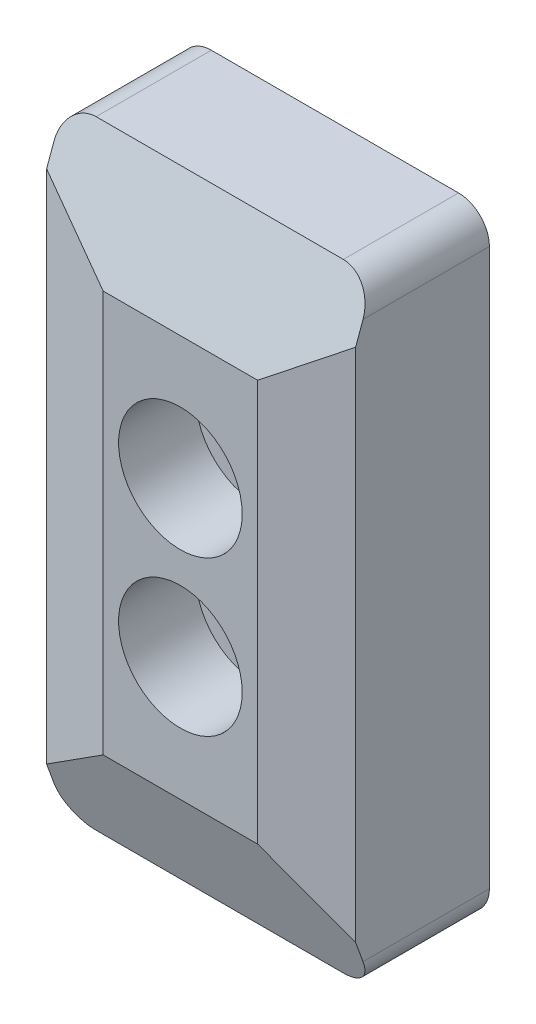
ISO-10303-21;
HEADER;
FILE_DESCRIPTION(('STEP AP214'),'2;1');
FILE_NAME('part.step','',(''),(''),'','','');
FILE_SCHEMA(('AUTOMOTIVE_DESIGN { 1 0 10303 214 1 1 1 1 }'));
ENDSEC;
DATA;
#1=APPLICATION_CONTEXT('core data for automotive mechanical design processes');
#2=APPLICATION_PROTOCOL_DEFINITION('international standard','automotive_design',2000,#1);
#3=PRODUCT_CONTEXT('',#1,'mechanical');
#4=PRODUCT('Part','Part','',(#3));
#5=PRODUCT_RELATED_PRODUCT_CATEGORY('part','',(#4));
#6=PRODUCT_DEFINITION_FORMATION('','',#4);
#7=PRODUCT_DEFINITION_CONTEXT('part definition',#1,'design');
#8=PRODUCT_DEFINITION('design','',#6,#7);
#9=PRODUCT_DEFINITION_SHAPE('','',#8);
#10=(LENGTH_UNIT() NAMED_UNIT(*) SI_UNIT(.MILLI.,.METRE.));
#11=(NAMED_UNIT(*) PLANE_ANGLE_UNIT() SI_UNIT($,.RADIAN.));
#12=(NAMED_UNIT(*) SI_UNIT($,.STERADIAN.) SOLID_ANGLE_UNIT());
#13=UNCERTAINTY_MEASURE_WITH_UNIT(LENGTH_MEASURE(1.E-05),#10,'distance_accuracy_value','');
#14=(GEOMETRIC_REPRESENTATION_CONTEXT(3) GLOBAL_UNCERTAINTY_ASSIGNED_CONTEXT((#13)) GLOBAL_UNIT_ASSIGNED_CONTEXT((#10,
#11,#12)) REPRESENTATION_CONTEXT('',''));
#15=CARTESIAN_POINT('',(0.,0.,0.));
#16=DIRECTION('',(0.,0.,1.));
#17=DIRECTION('',(1.,0.,0.));
#18=AXIS2_PLACEMENT_3D('',#15,#16,#17);
#19=CARTESIAN_POINT('',(0.,-5.,10.));
#20=DIRECTION('',(0.,0.,-1.));
#21=DIRECTION('',(-1.,0.,0.));
#22=AXIS2_PLACEMENT_3D('',#19,#20,#21);
#23=CYLINDRICAL_SURFACE('',#22,2.15);
#24=CARTESIAN_POINT('',(0.,-5.,0.));
#25=DIRECTION('',(0.,0.,1.));
#26=DIRECTION('',(1.,0.,0.));
#27=AXIS2_PLACEMENT_3D('',#24,#25,#26);
#28=CIRCLE('',#27,2.15);
#29=CARTESIAN_POINT('',(2.15,-5.,0.));
#30=VERTEX_POINT('',#29);
#31=EDGE_CURVE('E245',#30,#30,#28,.T.);
#32=ORIENTED_EDGE('',*,*,#31,.F.);
#33=EDGE_LOOP('',(#32));
#34=FACE_BOUND('',#33,.T.);
#35=CARTESIAN_POINT('',(0.,-5.,5.));
#36=DIRECTION('',(0.,0.,1.));
#37=DIRECTION('',(1.,0.,0.));
#38=AXIS2_PLACEMENT_3D('',#35,#36,#37);
#39=CIRCLE('',#38,2.15);
#40=CARTESIAN_POINT('',(2.15,-5.,5.));
#41=VERTEX_POINT('',#40);
#42=EDGE_CURVE('E188',#41,#41,#39,.T.);
#43=ORIENTED_EDGE('',*,*,#42,.T.);
#44=EDGE_LOOP('',(#43));
#45=FACE_BOUND('',#44,.T.);
#46=ADVANCED_FACE('F41',(#34,#45),#23,.F.);
#47=CARTESIAN_POINT('',(0.,5.,10.));
#48=DIRECTION('',(0.,0.,-1.));
#49=DIRECTION('',(-1.,0.,0.));
#50=AXIS2_PLACEMENT_3D('',#47,#48,#49);
#51=CYLINDRICAL_SURFACE('',#50,2.15);
#52=CARTESIAN_POINT('',(0.,5.,0.));
#53=DIRECTION('',(0.,0.,1.));
#54=DIRECTION('',(1.,0.,0.));
#55=AXIS2_PLACEMENT_3D('',#52,#53,#54);
#56=CIRCLE('',#55,2.15);
#57=CARTESIAN_POINT('',(2.15,5.,0.));
#58=VERTEX_POINT('',#57);
#59=EDGE_CURVE('E192',#58,#58,#56,.T.);
#60=ORIENTED_EDGE('',*,*,#59,.F.);
#61=EDGE_LOOP('',(#60));
#62=FACE_BOUND('',#61,.T.);
#63=CARTESIAN_POINT('',(0.,5.,5.));
#64=DIRECTION('',(0.,0.,1.));
#65=DIRECTION('',(1.,0.,0.));
#66=AXIS2_PLACEMENT_3D('',#63,#64,#65);
#67=CIRCLE('',#66,2.15);
#68=CARTESIAN_POINT('',(2.15,5.,5.));
#69=VERTEX_POINT('',#68);
#70=EDGE_CURVE('E185',#69,#69,#67,.T.);
#71=ORIENTED_EDGE('',*,*,#70,.T.);
#72=EDGE_LOOP('',(#71));
#73=FACE_BOUND('',#72,.T.);
#74=ADVANCED_FACE('F273',(#62,#73),#51,.F.);
#75=CARTESIAN_POINT('',(0.,0.,10.));
#76=DIRECTION('',(0.,0.,-1.));
#77=DIRECTION('',(-1.,0.,0.));
#78=AXIS2_PLACEMENT_3D('',#75,#76,#77);
#79=PLANE('',#78);
#80=CARTESIAN_POINT('',(0.,5.,10.));
#81=DIRECTION('',(0.,0.,1.));
#82=DIRECTION('',(1.,0.,0.));
#83=AXIS2_PLACEMENT_3D('',#80,#81,#82);
#84=CIRCLE('',#83,4.);
#85=CARTESIAN_POINT('',(4.,5.,10.));
#86=VERTEX_POINT('',#85);
#87=EDGE_CURVE('E256',#86,#86,#84,.T.);
#88=ORIENTED_EDGE('',*,*,#87,.F.);
#89=EDGE_LOOP('',(#88));
#90=FACE_BOUND('',#89,.T.);
#91=CARTESIAN_POINT('',(0.,-5.,10.));
#92=DIRECTION('',(0.,0.,1.));
#93=DIRECTION('',(1.,0.,0.));
#94=AXIS2_PLACEMENT_3D('',#91,#92,#93);
#95=CIRCLE('',#94,4.);
#96=CARTESIAN_POINT('',(4.,-5.,10.));
#97=VERTEX_POINT('',#96);
#98=EDGE_CURVE('E253',#97,#97,#95,.T.);
#99=ORIENTED_EDGE('',*,*,#98,.F.);
#100=EDGE_LOOP('',(#99));
#101=FACE_BOUND('',#100,.T.);
#102=DIRECTION('',(0.,-1.,0.));
#103=VECTOR('',#102,1.);
#104=CARTESIAN_POINT('',(-4.99999999999995,0.,10.));
#105=LINE('',#104,#103);
#106=CARTESIAN_POINT('',(-4.99999999999995,12.9999999999999,10.));
#107=VERTEX_POINT('',#106);
#108=CARTESIAN_POINT('',(-4.99999999999995,-12.9999999999999,10.));
#109=VERTEX_POINT('',#108);
#110=EDGE_CURVE('E151',#107,#109,#105,.T.);
#111=ORIENTED_EDGE('',*,*,#110,.T.);
#112=DIRECTION('',(1.,0.,0.));
#113=VECTOR('',#112,1.);
#114=CARTESIAN_POINT('',(0.,-12.9999999999999,10.));
#115=LINE('',#114,#113);
#116=CARTESIAN_POINT('',(4.99999999999994,-12.9999999999999,10.));
#117=VERTEX_POINT('',#116);
#118=EDGE_CURVE('E133',#109,#117,#115,.T.);
#119=ORIENTED_EDGE('',*,*,#118,.T.);
#120=DIRECTION('',(0.,1.,0.));
#121=VECTOR('',#120,1.);
#122=CARTESIAN_POINT('',(4.99999999999994,0.,10.));
#123=LINE('',#122,#121);
#124=CARTESIAN_POINT('',(4.99999999999994,12.9999999999999,10.));
#125=VERTEX_POINT('',#124);
#126=EDGE_CURVE('E148',#117,#125,#123,.T.);
#127=ORIENTED_EDGE('',*,*,#126,.T.);
#128=DIRECTION('',(-1.,0.,0.));
#129=VECTOR('',#128,1.);
#130=CARTESIAN_POINT('',(0.,12.9999999999999,10.));
#131=LINE('',#130,#129);
#132=EDGE_CURVE('E152',#125,#107,#131,.T.);
#133=ORIENTED_EDGE('',*,*,#132,.T.);
#134=EDGE_LOOP('',(#111,#119,#127,#133));
#135=FACE_BOUND('',#134,.T.);
#136=ADVANCED_FACE('F146',(#90,#101,#135),#79,.F.);
#137=CARTESIAN_POINT('',(0.,0.,0.));
#138=DIRECTION('',(0.,0.,-1.));
#139=DIRECTION('',(-1.,0.,0.));
#140=AXIS2_PLACEMENT_3D('',#137,#138,#139);
#141=PLANE('',#140);
#142=ORIENTED_EDGE('',*,*,#31,.T.);
#143=EDGE_LOOP('',(#142));
#144=FACE_BOUND('',#143,.T.);
#145=DIRECTION('',(0.,-1.,0.));
#146=VECTOR('',#145,1.);
#147=CARTESIAN_POINT('',(-10.,-20.,0.));
#148=LINE('',#147,#146);
#149=CARTESIAN_POINT('',(-10.,18.,0.));
#150=VERTEX_POINT('',#149);
#151=CARTESIAN_POINT('',(-10.,-18.,0.));
#152=VERTEX_POINT('',#151);
#153=EDGE_CURVE('E237',#150,#152,#148,.T.);
#154=ORIENTED_EDGE('',*,*,#153,.F.);
#155=CARTESIAN_POINT('',(-8.,18.,0.));
#156=DIRECTION('',(0.,0.,-1.));
#157=DIRECTION('',(-1.,0.,0.));
#158=AXIS2_PLACEMENT_3D('',#155,#156,#157);
#159=CIRCLE('',#158,2.);
#160=CARTESIAN_POINT('',(-8.,20.,0.));
#161=VERTEX_POINT('',#160);
#162=EDGE_CURVE('E203',#150,#161,#159,.T.);
#163=ORIENTED_EDGE('',*,*,#162,.T.);
#164=DIRECTION('',(-1.,0.,0.));
#165=VECTOR('',#164,1.);
#166=CARTESIAN_POINT('',(-10.,20.,0.));
#167=LINE('',#166,#165);
#168=CARTESIAN_POINT('',(8.,20.,0.));
#169=VERTEX_POINT('',#168);
#170=EDGE_CURVE('E239',#169,#161,#167,.T.);
#171=ORIENTED_EDGE('',*,*,#170,.F.);
#172=CARTESIAN_POINT('',(8.,18.,0.));
#173=DIRECTION('',(0.,0.,-1.));
#174=DIRECTION('',(-1.,0.,0.));
#175=AXIS2_PLACEMENT_3D('',#172,#173,#174);
#176=CIRCLE('',#175,2.);
#177=CARTESIAN_POINT('',(10.,18.,0.));
#178=VERTEX_POINT('',#177);
#179=EDGE_CURVE('E201',#169,#178,#176,.T.);
#180=ORIENTED_EDGE('',*,*,#179,.T.);
#181=DIRECTION('',(0.,1.,0.));
#182=VECTOR('',#181,1.);
#183=CARTESIAN_POINT('',(10.,-20.,0.));
#184=LINE('',#183,#182);
#185=CARTESIAN_POINT('',(10.,-18.,0.));
#186=VERTEX_POINT('',#185);
#187=EDGE_CURVE('E234',#186,#178,#184,.T.);
#188=ORIENTED_EDGE('',*,*,#187,.F.);
#189=CARTESIAN_POINT('',(8.,-18.,0.));
#190=DIRECTION('',(0.,0.,-1.));
#191=DIRECTION('',(-1.,0.,0.));
#192=AXIS2_PLACEMENT_3D('',#189,#190,#191);
#193=CIRCLE('',#192,2.);
#194=CARTESIAN_POINT('',(8.,-20.,0.));
#195=VERTEX_POINT('',#194);
#196=EDGE_CURVE('E197',#186,#195,#193,.T.);
#197=ORIENTED_EDGE('',*,*,#196,.T.);
#198=DIRECTION('',(1.,0.,0.));
#199=VECTOR('',#198,1.);
#200=CARTESIAN_POINT('',(-10.,-20.,0.));
#201=LINE('',#200,#199);
#202=CARTESIAN_POINT('',(-8.,-20.,0.));
#203=VERTEX_POINT('',#202);
#204=EDGE_CURVE('E160',#203,#195,#201,.T.);
#205=ORIENTED_EDGE('',*,*,#204,.F.);
#206=CARTESIAN_POINT('',(-8.,-18.,0.));
#207=DIRECTION('',(0.,0.,-1.));
#208=DIRECTION('',(-1.,0.,0.));
#209=AXIS2_PLACEMENT_3D('',#206,#207,#208);
#210=CIRCLE('',#209,2.);
#211=EDGE_CURVE('E199',#203,#152,#210,.T.);
#212=ORIENTED_EDGE('',*,*,#211,.T.);
#213=EDGE_LOOP('',(#154,#163,#171,#180,#188,#197,#205,#212));
#214=FACE_BOUND('',#213,.T.);
#215=ORIENTED_EDGE('',*,*,#59,.T.);
#216=EDGE_LOOP('',(#215));
#217=FACE_BOUND('',#216,.T.);
#218=ADVANCED_FACE('F232',(#144,#214,#217),#141,.T.);
#219=CARTESIAN_POINT('',(10.,-20.,10.));
#220=DIRECTION('',(-1.,0.,0.));
#221=DIRECTION('',(0.,0.,1.));
#222=AXIS2_PLACEMENT_3D('',#219,#220,#221);
#223=PLANE('',#222);
#224=ORIENTED_EDGE('',*,*,#187,.T.);
#225=DIRECTION('',(0.,0.,-1.));
#226=VECTOR('',#225,1.);
#227=CARTESIAN_POINT('',(10.,18.,10.));
#228=LINE('',#227,#226);
#229=CARTESIAN_POINT('',(10.,18.,8.18014882866898));
#230=VERTEX_POINT('',#229);
#231=EDGE_CURVE('E217',#178,#230,#228,.F.);
#232=ORIENTED_EDGE('',*,*,#231,.T.);
#233=DIRECTION('',(0.,0.939692620785909,-0.342020143325666));
#234=VECTOR('',#233,1.);
#235=CARTESIAN_POINT('',(10.,12.9999999999999,10.));
#236=LINE('',#235,#234);
#237=CARTESIAN_POINT('',(10.,16.680921778828,8.66025403784439));
#238=VERTEX_POINT('',#237);
#239=EDGE_CURVE('E140',#230,#238,#236,.F.);
#240=ORIENTED_EDGE('',*,*,#239,.T.);
#241=DIRECTION('',(0.,-1.,0.));
#242=VECTOR('',#241,1.);
#243=CARTESIAN_POINT('',(10.,-20.,8.66025403784439));
#244=LINE('',#243,#242);
#245=CARTESIAN_POINT('',(10.,-16.680921778828,8.66025403784439));
#246=VERTEX_POINT('',#245);
#247=EDGE_CURVE('E156',#238,#246,#244,.T.);
#248=ORIENTED_EDGE('',*,*,#247,.T.);
#249=DIRECTION('',(0.,0.939692620785909,0.342020143325666));
#250=VECTOR('',#249,1.);
#251=CARTESIAN_POINT('',(10.,-12.9999999999999,10.));
#252=LINE('',#251,#250);
#253=CARTESIAN_POINT('',(10.,-18.,8.18014882866898));
#254=VERTEX_POINT('',#253);
#255=EDGE_CURVE('E135',#246,#254,#252,.F.);
#256=ORIENTED_EDGE('',*,*,#255,.T.);
#257=DIRECTION('',(0.,0.,-1.));
#258=VECTOR('',#257,1.);
#259=CARTESIAN_POINT('',(10.,-18.,10.));
#260=LINE('',#259,#258);
#261=EDGE_CURVE('E214',#254,#186,#260,.T.);
#262=ORIENTED_EDGE('',*,*,#261,.T.);
#263=EDGE_LOOP('',(#224,#232,#240,#248,#256,#262));
#264=FACE_BOUND('',#263,.T.);
#265=ADVANCED_FACE('F227',(#264),#223,.F.);
#266=CARTESIAN_POINT('',(-10.,20.,10.));
#267=DIRECTION('',(0.,-1.,0.));
#268=DIRECTION('',(0.,0.,-1.));
#269=AXIS2_PLACEMENT_3D('',#266,#267,#268);
#270=PLANE('',#269);
#271=ORIENTED_EDGE('',*,*,#170,.T.);
#272=DIRECTION('',(0.,0.,-1.));
#273=VECTOR('',#272,1.);
#274=CARTESIAN_POINT('',(-8.,20.,10.));
#275=LINE('',#274,#273);
#276=CARTESIAN_POINT('',(-8.,20.,7.45220836013658));
#277=VERTEX_POINT('',#276);
#278=EDGE_CURVE('E208',#161,#277,#275,.F.);
#279=ORIENTED_EDGE('',*,*,#278,.T.);
#280=DIRECTION('',(1.,0.,0.));
#281=VECTOR('',#280,1.);
#282=CARTESIAN_POINT('',(-10.,20.,7.45220836013658));
#283=LINE('',#282,#281);
#284=CARTESIAN_POINT('',(8.,20.,7.45220836013658));
#285=VERTEX_POINT('',#284);
#286=EDGE_CURVE('E181',#277,#285,#283,.T.);
#287=ORIENTED_EDGE('',*,*,#286,.T.);
#288=DIRECTION('',(0.,0.,-1.));
#289=VECTOR('',#288,1.);
#290=CARTESIAN_POINT('',(8.,20.,10.));
#291=LINE('',#290,#289);
#292=EDGE_CURVE('E205',#285,#169,#291,.T.);
#293=ORIENTED_EDGE('',*,*,#292,.T.);
#294=EDGE_LOOP('',(#271,#279,#287,#293));
#295=FACE_BOUND('',#294,.T.);
#296=ADVANCED_FACE('F312',(#295),#270,.F.);
#297=CARTESIAN_POINT('',(-10.,-20.,10.));
#298=DIRECTION('',(1.,0.,0.));
#299=DIRECTION('',(0.,0.,-1.));
#300=AXIS2_PLACEMENT_3D('',#297,#298,#299);
#301=PLANE('',#300);
#302=DIRECTION('',(0.,-0.939692620785909,0.342020143325666));
#303=VECTOR('',#302,1.);
#304=CARTESIAN_POINT('',(-10.,12.9999999999999,10.));
#305=LINE('',#304,#303);
#306=CARTESIAN_POINT('',(-10.,16.680921778828,8.66025403784439));
#307=VERTEX_POINT('',#306);
#308=CARTESIAN_POINT('',(-10.,18.,8.18014882866898));
#309=VERTEX_POINT('',#308);
#310=EDGE_CURVE('E172',#307,#309,#305,.F.);
#311=ORIENTED_EDGE('',*,*,#310,.T.);
#312=DIRECTION('',(0.,0.,-1.));
#313=VECTOR('',#312,1.);
#314=CARTESIAN_POINT('',(-10.,18.,10.));
#315=LINE('',#314,#313);
#316=EDGE_CURVE('E194',#309,#150,#315,.T.);
#317=ORIENTED_EDGE('',*,*,#316,.T.);
#318=ORIENTED_EDGE('',*,*,#153,.T.);
#319=DIRECTION('',(0.,0.,-1.));
#320=VECTOR('',#319,1.);
#321=CARTESIAN_POINT('',(-10.,-18.,10.));
#322=LINE('',#321,#320);
#323=CARTESIAN_POINT('',(-10.,-18.,8.18014882866898));
#324=VERTEX_POINT('',#323);
#325=EDGE_CURVE('E184',#152,#324,#322,.F.);
#326=ORIENTED_EDGE('',*,*,#325,.T.);
#327=DIRECTION('',(0.,-0.939692620785909,-0.342020143325666));
#328=VECTOR('',#327,1.);
#329=CARTESIAN_POINT('',(-10.,-12.9999999999999,10.));
#330=LINE('',#329,#328);
#331=CARTESIAN_POINT('',(-10.,-16.680921778828,8.66025403784439));
#332=VERTEX_POINT('',#331);
#333=EDGE_CURVE('E175',#324,#332,#330,.F.);
#334=ORIENTED_EDGE('',*,*,#333,.T.);
#335=DIRECTION('',(0.,1.,0.));
#336=VECTOR('',#335,1.);
#337=CARTESIAN_POINT('',(-10.,-20.,8.66025403784439));
#338=LINE('',#337,#336);
#339=EDGE_CURVE('E158',#332,#307,#338,.T.);
#340=ORIENTED_EDGE('',*,*,#339,.T.);
#341=EDGE_LOOP('',(#311,#317,#318,#326,#334,#340));
#342=FACE_BOUND('',#341,.T.);
#343=ADVANCED_FACE('F309',(#342),#301,.F.);
#344=CARTESIAN_POINT('',(-10.,-20.,10.));
#345=DIRECTION('',(0.,1.,0.));
#346=DIRECTION('',(0.,0.,1.));
#347=AXIS2_PLACEMENT_3D('',#344,#345,#346);
#348=PLANE('',#347);
#349=DIRECTION('',(-1.,0.,0.));
#350=VECTOR('',#349,1.);
#351=CARTESIAN_POINT('',(-10.,-20.,7.45220836013658));
#352=LINE('',#351,#350);
#353=CARTESIAN_POINT('',(8.,-20.,7.45220836013658));
#354=VERTEX_POINT('',#353);
#355=CARTESIAN_POINT('',(-8.,-20.,7.45220836013658));
#356=VERTEX_POINT('',#355);
#357=EDGE_CURVE('E170',#354,#356,#352,.T.);
#358=ORIENTED_EDGE('',*,*,#357,.T.);
#359=DIRECTION('',(0.,0.,-1.));
#360=VECTOR('',#359,1.);
#361=CARTESIAN_POINT('',(-8.,-20.,10.));
#362=LINE('',#361,#360);
#363=EDGE_CURVE('E220',#356,#203,#362,.T.);
#364=ORIENTED_EDGE('',*,*,#363,.T.);
#365=ORIENTED_EDGE('',*,*,#204,.T.);
#366=DIRECTION('',(0.,0.,-1.));
#367=VECTOR('',#366,1.);
#368=CARTESIAN_POINT('',(8.,-20.,10.));
#369=LINE('',#368,#367);
#370=EDGE_CURVE('E61',#195,#354,#369,.F.);
#371=ORIENTED_EDGE('',*,*,#370,.T.);
#372=EDGE_LOOP('',(#358,#364,#365,#371));
#373=FACE_BOUND('',#372,.T.);
#374=ADVANCED_FACE('F235',(#373),#348,.F.);
#375=CARTESIAN_POINT('',(4.99999999999994,0.,10.));
#376=DIRECTION('',(-0.258819045102518,0.,-0.965925826289069));
#377=DIRECTION('',(0.,1.,0.));
#378=AXIS2_PLACEMENT_3D('',#375,#376,#377);
#379=PLANE('',#378);
#380=ORIENTED_EDGE('',*,*,#126,.F.);
#381=DIRECTION('',(0.787190718656812,-0.579517492079032,-0.210927117353366));
#382=VECTOR('',#381,1.);
#383=CARTESIAN_POINT('',(-0.930480283830553,-8.63407319286752,11.5890674027811));
#384=LINE('',#383,#382);
#385=EDGE_CURVE('E129',#117,#246,#384,.T.);
#386=ORIENTED_EDGE('',*,*,#385,.T.);
#387=ORIENTED_EDGE('',*,*,#247,.F.);
#388=DIRECTION('',(-0.787190718656812,-0.579517492079032,0.210927117353366));
#389=VECTOR('',#388,1.);
#390=CARTESIAN_POINT('',(-0.930480283830558,8.63407319286753,11.5890674027811));
#391=LINE('',#390,#389);
#392=EDGE_CURVE('E141',#238,#125,#391,.T.);
#393=ORIENTED_EDGE('',*,*,#392,.T.);
#394=EDGE_LOOP('',(#380,#386,#387,#393));
#395=FACE_BOUND('',#394,.T.);
#396=ADVANCED_FACE('F154',(#395),#379,.F.);
#397=CARTESIAN_POINT('',(-4.99999999999995,0.,10.));
#398=DIRECTION('',(0.258819045102518,0.,-0.965925826289069));
#399=DIRECTION('',(0.,-1.,0.));
#400=AXIS2_PLACEMENT_3D('',#397,#398,#399);
#401=PLANE('',#400);
#402=ORIENTED_EDGE('',*,*,#339,.F.);
#403=DIRECTION('',(0.787190718656812,0.579517492079032,0.210927117353366));
#404=VECTOR('',#403,1.);
#405=CARTESIAN_POINT('',(0.930480283830546,-8.63407319286752,11.5890674027811));
#406=LINE('',#405,#404);
#407=EDGE_CURVE('E179',#332,#109,#406,.T.);
#408=ORIENTED_EDGE('',*,*,#407,.T.);
#409=ORIENTED_EDGE('',*,*,#110,.F.);
#410=DIRECTION('',(-0.787190718656812,0.579517492079032,-0.210927117353366));
#411=VECTOR('',#410,1.);
#412=CARTESIAN_POINT('',(0.930480283830551,8.63407319286753,11.5890674027811));
#413=LINE('',#412,#411);
#414=EDGE_CURVE('E177',#107,#307,#413,.T.);
#415=ORIENTED_EDGE('',*,*,#414,.T.);
#416=EDGE_LOOP('',(#402,#408,#409,#415));
#417=FACE_BOUND('',#416,.T.);
#418=ADVANCED_FACE('F325',(#417),#401,.F.);
#419=CARTESIAN_POINT('',(0.,-12.9999999999999,10.));
#420=DIRECTION('',(0.,0.342020143325666,-0.939692620785909));
#421=DIRECTION('',(1.,0.,0.));
#422=AXIS2_PLACEMENT_3D('',#419,#420,#421);
#423=PLANE('',#422);
#424=ORIENTED_EDGE('',*,*,#333,.F.);
#425=CARTESIAN_POINT('',(-8.,-18.,8.18014882866898));
#426=DIRECTION('',(0.,0.342020143325666,-0.939692620785909));
#427=DIRECTION('',(0.,-0.939692620785909,-0.342020143325666));
#428=AXIS2_PLACEMENT_3D('',#425,#426,#427);
#429=ELLIPSE('',#428,2.12835554495182,2.);
#430=EDGE_CURVE('E11',#324,#356,#429,.F.);
#431=ORIENTED_EDGE('',*,*,#430,.T.);
#432=ORIENTED_EDGE('',*,*,#357,.F.);
#433=CARTESIAN_POINT('',(8.,-18.,8.18014882866898));
#434=DIRECTION('',(0.,0.342020143325666,-0.939692620785909));
#435=DIRECTION('',(0.,-0.939692620785909,-0.342020143325666));
#436=AXIS2_PLACEMENT_3D('',#433,#434,#435);
#437=ELLIPSE('',#436,2.12835554495182,2.);
#438=EDGE_CURVE('E49',#354,#254,#437,.F.);
#439=ORIENTED_EDGE('',*,*,#438,.T.);
#440=ORIENTED_EDGE('',*,*,#255,.F.);
#441=ORIENTED_EDGE('',*,*,#385,.F.);
#442=ORIENTED_EDGE('',*,*,#118,.F.);
#443=ORIENTED_EDGE('',*,*,#407,.F.);
#444=EDGE_LOOP('',(#424,#431,#432,#439,#440,#441,#442,#443));
#445=FACE_BOUND('',#444,.T.);
#446=ADVANCED_FACE('F131',(#445),#423,.F.);
#447=CARTESIAN_POINT('',(0.,12.9999999999999,10.));
#448=DIRECTION('',(0.,-0.342020143325666,-0.939692620785909));
#449=DIRECTION('',(-1.,0.,0.));
#450=AXIS2_PLACEMENT_3D('',#447,#448,#449);
#451=PLANE('',#450);
#452=ORIENTED_EDGE('',*,*,#286,.F.);
#453=CARTESIAN_POINT('',(-8.,18.,8.18014882866898));
#454=DIRECTION('',(0.,-0.342020143325666,-0.939692620785909));
#455=DIRECTION('',(0.,0.939692620785909,-0.342020143325666));
#456=AXIS2_PLACEMENT_3D('',#453,#454,#455);
#457=ELLIPSE('',#456,2.12835554495182,2.);
#458=EDGE_CURVE('E212',#277,#309,#457,.F.);
#459=ORIENTED_EDGE('',*,*,#458,.T.);
#460=ORIENTED_EDGE('',*,*,#310,.F.);
#461=ORIENTED_EDGE('',*,*,#414,.F.);
#462=ORIENTED_EDGE('',*,*,#132,.F.);
#463=ORIENTED_EDGE('',*,*,#392,.F.);
#464=ORIENTED_EDGE('',*,*,#239,.F.);
#465=CARTESIAN_POINT('',(8.,18.,8.18014882866898));
#466=DIRECTION('',(0.,-0.342020143325666,-0.939692620785909));
#467=DIRECTION('',(0.,0.939692620785909,-0.342020143325666));
#468=AXIS2_PLACEMENT_3D('',#465,#466,#467);
#469=ELLIPSE('',#468,2.12835554495182,2.);
#470=EDGE_CURVE('E210',#230,#285,#469,.F.);
#471=ORIENTED_EDGE('',*,*,#470,.T.);
#472=EDGE_LOOP('',(#452,#459,#460,#461,#462,#463,#464,#471));
#473=FACE_BOUND('',#472,.T.);
#474=ADVANCED_FACE('F267',(#473),#451,.F.);
#475=CARTESIAN_POINT('',(0.,5.,5.));
#476=DIRECTION('',(0.,0.,1.));
#477=DIRECTION('',(1.,0.,0.));
#478=AXIS2_PLACEMENT_3D('',#475,#476,#477);
#479=CYLINDRICAL_SURFACE('',#478,4.);
#480=CARTESIAN_POINT('',(0.,5.,5.));
#481=DIRECTION('',(0.,0.,1.));
#482=DIRECTION('',(1.,0.,0.));
#483=AXIS2_PLACEMENT_3D('',#480,#481,#482);
#484=CIRCLE('',#483,4.);
#485=CARTESIAN_POINT('',(4.,5.,5.));
#486=VERTEX_POINT('',#485);
#487=EDGE_CURVE('E189',#486,#486,#484,.T.);
#488=ORIENTED_EDGE('',*,*,#487,.F.);
#489=EDGE_LOOP('',(#488));
#490=FACE_BOUND('',#489,.T.);
#491=ORIENTED_EDGE('',*,*,#87,.T.);
#492=EDGE_LOOP('',(#491));
#493=FACE_BOUND('',#492,.T.);
#494=ADVANCED_FACE('F264',(#490,#493),#479,.F.);
#495=CARTESIAN_POINT('',(0.,5.,5.));
#496=DIRECTION('',(0.,0.,1.));
#497=DIRECTION('',(1.,0.,0.));
#498=AXIS2_PLACEMENT_3D('',#495,#496,#497);
#499=PLANE('',#498);
#500=ORIENTED_EDGE('',*,*,#70,.F.);
#501=EDGE_LOOP('',(#500));
#502=FACE_BOUND('',#501,.T.);
#503=ORIENTED_EDGE('',*,*,#487,.T.);
#504=EDGE_LOOP('',(#503));
#505=FACE_BOUND('',#504,.T.);
#506=ADVANCED_FACE('F262',(#502,#505),#499,.T.);
#507=CARTESIAN_POINT('',(0.,-5.,5.));
#508=DIRECTION('',(0.,0.,1.));
#509=DIRECTION('',(1.,0.,0.));
#510=AXIS2_PLACEMENT_3D('',#507,#508,#509);
#511=CYLINDRICAL_SURFACE('',#510,4.);
#512=CARTESIAN_POINT('',(0.,-5.,5.));
#513=DIRECTION('',(0.,0.,1.));
#514=DIRECTION('',(1.,0.,0.));
#515=AXIS2_PLACEMENT_3D('',#512,#513,#514);
#516=CIRCLE('',#515,4.);
#517=CARTESIAN_POINT('',(4.,-5.,5.));
#518=VERTEX_POINT('',#517);
#519=EDGE_CURVE('E250',#518,#518,#516,.T.);
#520=ORIENTED_EDGE('',*,*,#519,.F.);
#521=EDGE_LOOP('',(#520));
#522=FACE_BOUND('',#521,.T.);
#523=ORIENTED_EDGE('',*,*,#98,.T.);
#524=EDGE_LOOP('',(#523));
#525=FACE_BOUND('',#524,.T.);
#526=ADVANCED_FACE('F277',(#522,#525),#511,.F.);
#527=CARTESIAN_POINT('',(0.,-5.,5.));
#528=DIRECTION('',(0.,0.,1.));
#529=DIRECTION('',(1.,0.,0.));
#530=AXIS2_PLACEMENT_3D('',#527,#528,#529);
#531=PLANE('',#530);
#532=ORIENTED_EDGE('',*,*,#42,.F.);
#533=EDGE_LOOP('',(#532));
#534=FACE_BOUND('',#533,.T.);
#535=ORIENTED_EDGE('',*,*,#519,.T.);
#536=EDGE_LOOP('',(#535));
#537=FACE_BOUND('',#536,.T.);
#538=ADVANCED_FACE('F279',(#534,#537),#531,.T.);
#539=CARTESIAN_POINT('',(-8.,18.,10.));
#540=DIRECTION('',(0.,0.,-1.));
#541=DIRECTION('',(-1.,0.,0.));
#542=AXIS2_PLACEMENT_3D('',#539,#540,#541);
#543=CYLINDRICAL_SURFACE('',#542,2.);
#544=ORIENTED_EDGE('',*,*,#458,.F.);
#545=ORIENTED_EDGE('',*,*,#278,.F.);
#546=ORIENTED_EDGE('',*,*,#162,.F.);
#547=ORIENTED_EDGE('',*,*,#316,.F.);
#548=EDGE_LOOP('',(#544,#545,#546,#547));
#549=FACE_BOUND('',#548,.T.);
#550=ADVANCED_FACE('F286',(#549),#543,.T.);
#551=CARTESIAN_POINT('',(8.,18.,10.));
#552=DIRECTION('',(0.,0.,-1.));
#553=DIRECTION('',(-1.,0.,0.));
#554=AXIS2_PLACEMENT_3D('',#551,#552,#553);
#555=CYLINDRICAL_SURFACE('',#554,2.);
#556=ORIENTED_EDGE('',*,*,#470,.F.);
#557=ORIENTED_EDGE('',*,*,#231,.F.);
#558=ORIENTED_EDGE('',*,*,#179,.F.);
#559=ORIENTED_EDGE('',*,*,#292,.F.);
#560=EDGE_LOOP('',(#556,#557,#558,#559));
#561=FACE_BOUND('',#560,.T.);
#562=ADVANCED_FACE('F343',(#561),#555,.T.);
#563=CARTESIAN_POINT('',(-8.,-18.,10.));
#564=DIRECTION('',(0.,0.,-1.));
#565=DIRECTION('',(-1.,0.,0.));
#566=AXIS2_PLACEMENT_3D('',#563,#564,#565);
#567=CYLINDRICAL_SURFACE('',#566,2.);
#568=ORIENTED_EDGE('',*,*,#430,.F.);
#569=ORIENTED_EDGE('',*,*,#325,.F.);
#570=ORIENTED_EDGE('',*,*,#211,.F.);
#571=ORIENTED_EDGE('',*,*,#363,.F.);
#572=EDGE_LOOP('',(#568,#569,#570,#571));
#573=FACE_BOUND('',#572,.T.);
#574=ADVANCED_FACE('F346',(#573),#567,.T.);
#575=CARTESIAN_POINT('',(8.,-18.,10.));
#576=DIRECTION('',(0.,0.,-1.));
#577=DIRECTION('',(-1.,0.,0.));
#578=AXIS2_PLACEMENT_3D('',#575,#576,#577);
#579=CYLINDRICAL_SURFACE('',#578,2.);
#580=ORIENTED_EDGE('',*,*,#438,.F.);
#581=ORIENTED_EDGE('',*,*,#370,.F.);
#582=ORIENTED_EDGE('',*,*,#196,.F.);
#583=ORIENTED_EDGE('',*,*,#261,.F.);
#584=EDGE_LOOP('',(#580,#581,#582,#583));
#585=FACE_BOUND('',#584,.T.);
#586=ADVANCED_FACE('F43',(#585),#579,.T.);
#587=CLOSED_SHELL('',(#46,#74,#136,#218,#265,#296,#343,#374,#396,#418,#446,#474,#494,#506,#526,
#538,#550,#562,#574,#586));
#588=MANIFOLD_SOLID_BREP('B2',#587);
#589=ADVANCED_BREP_SHAPE_REPRESENTATION('',(#18,#588),#14);
#590=SHAPE_DEFINITION_REPRESENTATION(#9,#589);
ENDSEC;
END-ISO-10303-21;
